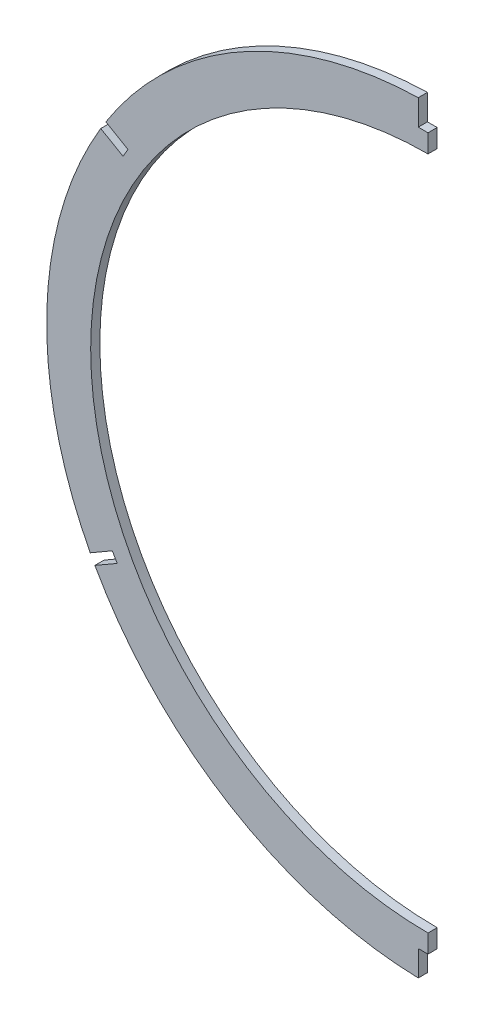
ISO-10303-21;
HEADER;
FILE_DESCRIPTION(('STEP AP214'),'2;1');
FILE_NAME('part.step','',(''),(''),'','','');
FILE_SCHEMA(('AUTOMOTIVE_DESIGN { 1 0 10303 214 1 1 1 1 }'));
ENDSEC;
DATA;
#1=APPLICATION_CONTEXT('core data for automotive mechanical design processes');
#2=APPLICATION_PROTOCOL_DEFINITION('international standard','automotive_design',2000,#1);
#3=PRODUCT_CONTEXT('',#1,'mechanical');
#4=PRODUCT('Part','Part','',(#3));
#5=PRODUCT_RELATED_PRODUCT_CATEGORY('part','',(#4));
#6=PRODUCT_DEFINITION_FORMATION('','',#4);
#7=PRODUCT_DEFINITION_CONTEXT('part definition',#1,'design');
#8=PRODUCT_DEFINITION('design','',#6,#7);
#9=PRODUCT_DEFINITION_SHAPE('','',#8);
#10=(LENGTH_UNIT() NAMED_UNIT(*) SI_UNIT(.MILLI.,.METRE.));
#11=(NAMED_UNIT(*) PLANE_ANGLE_UNIT() SI_UNIT($,.RADIAN.));
#12=(NAMED_UNIT(*) SI_UNIT($,.STERADIAN.) SOLID_ANGLE_UNIT());
#13=UNCERTAINTY_MEASURE_WITH_UNIT(LENGTH_MEASURE(1.E-05),#10,'distance_accuracy_value','');
#14=(GEOMETRIC_REPRESENTATION_CONTEXT(3) GLOBAL_UNCERTAINTY_ASSIGNED_CONTEXT((#13)) GLOBAL_UNIT_ASSIGNED_CONTEXT((#10,
#11,#12)) REPRESENTATION_CONTEXT('',''));
#15=CARTESIAN_POINT('',(0.,0.,0.));
#16=DIRECTION('',(0.,0.,1.));
#17=DIRECTION('',(1.,0.,0.));
#18=AXIS2_PLACEMENT_3D('',#15,#16,#17);
#19=CARTESIAN_POINT('',(0.,-3.556,1.5875));
#20=DIRECTION('',(0.,0.,-1.));
#21=DIRECTION('',(-1.,0.,0.));
#22=AXIS2_PLACEMENT_3D('',#19,#20,#21);
#23=CYLINDRICAL_SURFACE('',#22,132.08);
#24=CARTESIAN_POINT('',(0.,-3.556,-1.5875));
#25=DIRECTION('',(0.,0.,1.));
#26=DIRECTION('',(1.,0.,0.));
#27=AXIS2_PLACEMENT_3D('',#24,#25,#26);
#28=CIRCLE('',#27,132.08);
#29=CARTESIAN_POINT('',(-113.35726398149,64.2323257104845,-1.5875));
#30=VERTEX_POINT('',#29);
#31=CARTESIAN_POINT('',(-116.991774889811,-64.8589445306805,-1.5875));
#32=VERTEX_POINT('',#31);
#33=EDGE_CURVE('E251',#30,#32,#28,.T.);
#34=ORIENTED_EDGE('',*,*,#33,.T.);
#35=DIRECTION('',(0.,0.,-1.));
#36=VECTOR('',#35,1.);
#37=CARTESIAN_POINT('',(-116.991774889811,-64.8589445306805,1.5875));
#38=LINE('',#37,#36);
#39=CARTESIAN_POINT('',(-116.991774889811,-64.8589445306805,1.5875));
#40=VERTEX_POINT('',#39);
#41=EDGE_CURVE('E265',#32,#40,#38,.F.);
#42=ORIENTED_EDGE('',*,*,#41,.T.);
#43=CARTESIAN_POINT('',(0.,-3.556,1.5875));
#44=DIRECTION('',(0.,0.,1.));
#45=DIRECTION('',(1.,0.,0.));
#46=AXIS2_PLACEMENT_3D('',#43,#44,#45);
#47=CIRCLE('',#46,132.08);
#48=CARTESIAN_POINT('',(-113.35726398149,64.2323257104845,1.5875));
#49=VERTEX_POINT('',#48);
#50=EDGE_CURVE('E247',#49,#40,#47,.T.);
#51=ORIENTED_EDGE('',*,*,#50,.F.);
#52=DIRECTION('',(0.,0.,-1.));
#53=VECTOR('',#52,1.);
#54=CARTESIAN_POINT('',(-113.35726398149,64.2323257104845,1.5875));
#55=LINE('',#54,#53);
#56=EDGE_CURVE('E258',#49,#30,#55,.T.);
#57=ORIENTED_EDGE('',*,*,#56,.T.);
#58=EDGE_LOOP('',(#34,#42,#51,#57));
#59=FACE_BOUND('',#58,.T.);
#60=ADVANCED_FACE('F36',(#59),#23,.T.);
#61=CARTESIAN_POINT('',(-3.3782,128.480790951462,1.5875));
#62=VERTEX_POINT('',#61);
#63=CARTESIAN_POINT('',(-111.585794735263,67.1103768230669,1.5875));
#64=VERTEX_POINT('',#63);
#65=EDGE_CURVE('E248',#62,#64,#47,.T.);
#66=ORIENTED_EDGE('',*,*,#65,.F.);
#67=DIRECTION('',(0.,0.,-1.));
#68=VECTOR('',#67,1.);
#69=CARTESIAN_POINT('',(-3.3782,128.480790951462,1.5875));
#70=LINE('',#69,#68);
#71=CARTESIAN_POINT('',(-3.3782,128.480790951462,-1.5875));
#72=VERTEX_POINT('',#71);
#73=EDGE_CURVE('E11',#62,#72,#70,.T.);
#74=ORIENTED_EDGE('',*,*,#73,.T.);
#75=CARTESIAN_POINT('',(-111.585794735263,67.1103768230669,-1.5875));
#76=VERTEX_POINT('',#75);
#77=EDGE_CURVE('E171',#72,#76,#28,.T.);
#78=ORIENTED_EDGE('',*,*,#77,.T.);
#79=DIRECTION('',(0.,0.,-1.));
#80=VECTOR('',#79,1.);
#81=CARTESIAN_POINT('',(-111.585794735263,67.1103768230669,1.5875));
#82=LINE('',#81,#80);
#83=EDGE_CURVE('E260',#76,#64,#82,.F.);
#84=ORIENTED_EDGE('',*,*,#83,.T.);
#85=EDGE_LOOP('',(#66,#74,#78,#84));
#86=FACE_BOUND('',#85,.T.);
#87=ADVANCED_FACE('F304',(#86),#23,.T.);
#88=CARTESIAN_POINT('',(0.,-3.556,1.5875));
#89=DIRECTION('',(0.,0.,1.));
#90=DIRECTION('',(1.,0.,0.));
#91=AXIS2_PLACEMENT_3D('',#88,#89,#90);
#92=PLANE('',#91);
#93=DIRECTION('',(0.,-1.,0.));
#94=VECTOR('',#93,1.);
#95=CARTESIAN_POINT('',(-3.3782,119.634,1.5875));
#96=LINE('',#95,#94);
#97=CARTESIAN_POINT('',(-3.3782,119.634,1.5875));
#98=VERTEX_POINT('',#97);
#99=EDGE_CURVE('E154',#62,#98,#96,.T.);
#100=ORIENTED_EDGE('',*,*,#99,.F.);
#101=ORIENTED_EDGE('',*,*,#65,.T.);
#102=DIRECTION('',(-0.866025403784439,0.499999999999999,0.));
#103=VECTOR('',#102,1.);
#104=CARTESIAN_POINT('',(-103.931466897998,62.6911485857563,1.5875));
#105=LINE('',#104,#103);
#106=CARTESIAN_POINT('',(-103.931466897998,62.6911485857563,1.5875));
#107=VERTEX_POINT('',#106);
#108=EDGE_CURVE('E220',#107,#64,#105,.T.);
#109=ORIENTED_EDGE('',*,*,#108,.F.);
#110=DIRECTION('',(0.500000000000002,0.866025403784437,0.));
#111=VECTOR('',#110,1.);
#112=CARTESIAN_POINT('',(-105.620566897998,59.7655415666918,1.5875));
#113=LINE('',#112,#111);
#114=CARTESIAN_POINT('',(-105.620566897998,59.7655415666918,1.5875));
#115=VERTEX_POINT('',#114);
#116=EDGE_CURVE('E222',#115,#107,#113,.T.);
#117=ORIENTED_EDGE('',*,*,#116,.F.);
#118=DIRECTION('',(0.866025403784438,-0.500000000000001,0.));
#119=VECTOR('',#118,1.);
#120=CARTESIAN_POINT('',(-105.620566897998,59.7655415666918,1.5875));
#121=LINE('',#120,#119);
#122=EDGE_CURVE('E201',#49,#115,#121,.T.);
#123=ORIENTED_EDGE('',*,*,#122,.F.);
#124=ORIENTED_EDGE('',*,*,#50,.T.);
#125=DIRECTION('',(-0.866025403784439,-0.5,0.));
#126=VECTOR('',#125,1.);
#127=CARTESIAN_POINT('',(-109.337447052546,-60.4397162933699,1.5875));
#128=LINE('',#127,#126);
#129=CARTESIAN_POINT('',(-109.337447052546,-60.4397162933699,1.5875));
#130=VERTEX_POINT('',#129);
#131=EDGE_CURVE('E185',#130,#40,#128,.T.);
#132=ORIENTED_EDGE('',*,*,#131,.F.);
#133=DIRECTION('',(-0.500000000000001,0.866025403784438,0.));
#134=VECTOR('',#133,1.);
#135=CARTESIAN_POINT('',(-107.648347052546,-63.3653233124345,1.5875));
#136=LINE('',#135,#134);
#137=CARTESIAN_POINT('',(-107.648347052546,-63.3653233124345,1.5875));
#138=VERTEX_POINT('',#137);
#139=EDGE_CURVE('E202',#138,#130,#136,.T.);
#140=ORIENTED_EDGE('',*,*,#139,.F.);
#141=DIRECTION('',(0.866025403784438,0.500000000000001,0.));
#142=VECTOR('',#141,1.);
#143=CARTESIAN_POINT('',(-107.648347052546,-63.3653233124345,1.5875));
#144=LINE('',#143,#142);
#145=CARTESIAN_POINT('',(-115.385044136038,-67.8321074562272,1.5875));
#146=VERTEX_POINT('',#145);
#147=EDGE_CURVE('E205',#146,#138,#144,.T.);
#148=ORIENTED_EDGE('',*,*,#147,.F.);
#149=CARTESIAN_POINT('',(-3.3782,-135.592790951462,1.5875));
#150=VERTEX_POINT('',#149);
#151=EDGE_CURVE('E244',#146,#150,#47,.T.);
#152=ORIENTED_EDGE('',*,*,#151,.T.);
#153=DIRECTION('',(0.,-1.,0.));
#154=VECTOR('',#153,1.);
#155=CARTESIAN_POINT('',(-3.3782,-126.746,1.5875));
#156=LINE('',#155,#154);
#157=CARTESIAN_POINT('',(-3.3782,-126.746,1.5875));
#158=VERTEX_POINT('',#157);
#159=EDGE_CURVE('E176',#158,#150,#156,.T.);
#160=ORIENTED_EDGE('',*,*,#159,.F.);
#161=DIRECTION('',(-1.,0.,0.));
#162=VECTOR('',#161,1.);
#163=CARTESIAN_POINT('',(0.,-126.746,1.5875));
#164=LINE('',#163,#162);
#165=CARTESIAN_POINT('',(0.,-126.746,1.5875));
#166=VERTEX_POINT('',#165);
#167=EDGE_CURVE('E186',#166,#158,#164,.T.);
#168=ORIENTED_EDGE('',*,*,#167,.F.);
#169=DIRECTION('',(0.,1.,0.));
#170=VECTOR('',#169,1.);
#171=CARTESIAN_POINT('',(0.,-3.556,1.5875));
#172=LINE('',#171,#170);
#173=CARTESIAN_POINT('',(0.,-120.396,1.5875));
#174=VERTEX_POINT('',#173);
#175=EDGE_CURVE('E236',#166,#174,#172,.T.);
#176=ORIENTED_EDGE('',*,*,#175,.T.);
#177=CARTESIAN_POINT('',(0.,-3.556,1.5875));
#178=DIRECTION('',(0.,0.,1.));
#179=DIRECTION('',(1.,0.,0.));
#180=AXIS2_PLACEMENT_3D('',#177,#178,#179);
#181=CIRCLE('',#180,116.84);
#182=CARTESIAN_POINT('',(0.,113.284,1.5875));
#183=VERTEX_POINT('',#182);
#184=EDGE_CURVE('E237',#183,#174,#181,.T.);
#185=ORIENTED_EDGE('',*,*,#184,.F.);
#186=CARTESIAN_POINT('',(0.,119.634,1.5875));
#187=VERTEX_POINT('',#186);
#188=EDGE_CURVE('E232',#183,#187,#172,.T.);
#189=ORIENTED_EDGE('',*,*,#188,.T.);
#190=DIRECTION('',(1.,0.,0.));
#191=VECTOR('',#190,1.);
#192=CARTESIAN_POINT('',(0.,119.634,1.5875));
#193=LINE('',#192,#191);
#194=EDGE_CURVE('E172',#98,#187,#193,.T.);
#195=ORIENTED_EDGE('',*,*,#194,.F.);
#196=EDGE_LOOP('',(#100,#101,#109,#117,#123,#124,#132,#140,#148,#152,#160,#168,#176,#185,#189,#195));
#197=FACE_BOUND('',#196,.T.);
#198=ADVANCED_FACE('F276',(#197),#92,.T.);
#199=CARTESIAN_POINT('',(0.,-3.556,-1.5875));
#200=DIRECTION('',(0.,0.,1.));
#201=DIRECTION('',(1.,0.,0.));
#202=AXIS2_PLACEMENT_3D('',#199,#200,#201);
#203=PLANE('',#202);
#204=ORIENTED_EDGE('',*,*,#77,.F.);
#205=DIRECTION('',(0.,-1.,0.));
#206=VECTOR('',#205,1.);
#207=CARTESIAN_POINT('',(-3.3782,119.634,-1.5875));
#208=LINE('',#207,#206);
#209=CARTESIAN_POINT('',(-3.3782,119.634,-1.5875));
#210=VERTEX_POINT('',#209);
#211=EDGE_CURVE('E152',#72,#210,#208,.T.);
#212=ORIENTED_EDGE('',*,*,#211,.T.);
#213=DIRECTION('',(1.,0.,0.));
#214=VECTOR('',#213,1.);
#215=CARTESIAN_POINT('',(0.,119.634,-1.5875));
#216=LINE('',#215,#214);
#217=CARTESIAN_POINT('',(0.,119.634,-1.5875));
#218=VERTEX_POINT('',#217);
#219=EDGE_CURVE('E158',#210,#218,#216,.T.);
#220=ORIENTED_EDGE('',*,*,#219,.T.);
#221=DIRECTION('',(0.,1.,0.));
#222=VECTOR('',#221,1.);
#223=CARTESIAN_POINT('',(0.,-3.556,-1.5875));
#224=LINE('',#223,#222);
#225=CARTESIAN_POINT('',(0.,113.284,-1.5875));
#226=VERTEX_POINT('',#225);
#227=EDGE_CURVE('E178',#226,#218,#224,.T.);
#228=ORIENTED_EDGE('',*,*,#227,.F.);
#229=CARTESIAN_POINT('',(0.,-3.556,-1.5875));
#230=DIRECTION('',(0.,0.,1.));
#231=DIRECTION('',(1.,0.,0.));
#232=AXIS2_PLACEMENT_3D('',#229,#230,#231);
#233=CIRCLE('',#232,116.84);
#234=CARTESIAN_POINT('',(0.,-120.396,-1.5875));
#235=VERTEX_POINT('',#234);
#236=EDGE_CURVE('E241',#226,#235,#233,.T.);
#237=ORIENTED_EDGE('',*,*,#236,.T.);
#238=CARTESIAN_POINT('',(0.,-126.746,-1.5875));
#239=VERTEX_POINT('',#238);
#240=EDGE_CURVE('E233',#239,#235,#224,.T.);
#241=ORIENTED_EDGE('',*,*,#240,.F.);
#242=DIRECTION('',(-1.,0.,0.));
#243=VECTOR('',#242,1.);
#244=CARTESIAN_POINT('',(0.,-126.746,-1.5875));
#245=LINE('',#244,#243);
#246=CARTESIAN_POINT('',(-3.3782,-126.746,-1.5875));
#247=VERTEX_POINT('',#246);
#248=EDGE_CURVE('E182',#239,#247,#245,.T.);
#249=ORIENTED_EDGE('',*,*,#248,.T.);
#250=DIRECTION('',(0.,-1.,0.));
#251=VECTOR('',#250,1.);
#252=CARTESIAN_POINT('',(-3.3782,-126.746,-1.5875));
#253=LINE('',#252,#251);
#254=CARTESIAN_POINT('',(-3.3782,-135.592790951462,-1.5875));
#255=VERTEX_POINT('',#254);
#256=EDGE_CURVE('E189',#247,#255,#253,.T.);
#257=ORIENTED_EDGE('',*,*,#256,.T.);
#258=CARTESIAN_POINT('',(-115.385044136038,-67.8321074562272,-1.5875));
#259=VERTEX_POINT('',#258);
#260=EDGE_CURVE('E240',#259,#255,#28,.T.);
#261=ORIENTED_EDGE('',*,*,#260,.F.);
#262=DIRECTION('',(0.866025403784438,0.500000000000001,0.));
#263=VECTOR('',#262,1.);
#264=CARTESIAN_POINT('',(-107.648347052546,-63.3653233124345,-1.5875));
#265=LINE('',#264,#263);
#266=CARTESIAN_POINT('',(-107.648347052546,-63.3653233124345,-1.5875));
#267=VERTEX_POINT('',#266);
#268=EDGE_CURVE('E51',#259,#267,#265,.T.);
#269=ORIENTED_EDGE('',*,*,#268,.T.);
#270=DIRECTION('',(-0.500000000000001,0.866025403784438,0.));
#271=VECTOR('',#270,1.);
#272=CARTESIAN_POINT('',(-107.648347052546,-63.3653233124345,-1.5875));
#273=LINE('',#272,#271);
#274=CARTESIAN_POINT('',(-109.337447052546,-60.4397162933699,-1.5875));
#275=VERTEX_POINT('',#274);
#276=EDGE_CURVE('E198',#267,#275,#273,.T.);
#277=ORIENTED_EDGE('',*,*,#276,.T.);
#278=DIRECTION('',(-0.866025403784439,-0.5,0.));
#279=VECTOR('',#278,1.);
#280=CARTESIAN_POINT('',(-109.337447052546,-60.4397162933699,-1.5875));
#281=LINE('',#280,#279);
#282=EDGE_CURVE('E206',#275,#32,#281,.T.);
#283=ORIENTED_EDGE('',*,*,#282,.T.);
#284=ORIENTED_EDGE('',*,*,#33,.F.);
#285=DIRECTION('',(0.866025403784438,-0.500000000000001,0.));
#286=VECTOR('',#285,1.);
#287=CARTESIAN_POINT('',(-105.620566897998,59.7655415666918,-1.5875));
#288=LINE('',#287,#286);
#289=CARTESIAN_POINT('',(-105.620566897998,59.7655415666918,-1.5875));
#290=VERTEX_POINT('',#289);
#291=EDGE_CURVE('E59',#30,#290,#288,.T.);
#292=ORIENTED_EDGE('',*,*,#291,.T.);
#293=DIRECTION('',(0.500000000000002,0.866025403784437,0.));
#294=VECTOR('',#293,1.);
#295=CARTESIAN_POINT('',(-105.620566897998,59.7655415666918,-1.5875));
#296=LINE('',#295,#294);
#297=CARTESIAN_POINT('',(-103.931466897998,62.6911485857563,-1.5875));
#298=VERTEX_POINT('',#297);
#299=EDGE_CURVE('E227',#290,#298,#296,.T.);
#300=ORIENTED_EDGE('',*,*,#299,.T.);
#301=DIRECTION('',(-0.866025403784439,0.499999999999999,0.));
#302=VECTOR('',#301,1.);
#303=CARTESIAN_POINT('',(-103.931466897998,62.6911485857563,-1.5875));
#304=LINE('',#303,#302);
#305=EDGE_CURVE('E217',#298,#76,#304,.T.);
#306=ORIENTED_EDGE('',*,*,#305,.T.);
#307=EDGE_LOOP('',(#204,#212,#220,#228,#237,#241,#249,#257,#261,#269,#277,#283,#284,#292,#300,#306));
#308=FACE_BOUND('',#307,.T.);
#309=ADVANCED_FACE('F168',(#308),#203,.F.);
#310=ORIENTED_EDGE('',*,*,#260,.T.);
#311=DIRECTION('',(0.,0.,-1.));
#312=VECTOR('',#311,1.);
#313=CARTESIAN_POINT('',(-3.3782,-135.592790951462,1.5875));
#314=LINE('',#313,#312);
#315=EDGE_CURVE('E44',#255,#150,#314,.F.);
#316=ORIENTED_EDGE('',*,*,#315,.T.);
#317=ORIENTED_EDGE('',*,*,#151,.F.);
#318=DIRECTION('',(0.,0.,-1.));
#319=VECTOR('',#318,1.);
#320=CARTESIAN_POINT('',(-115.385044136038,-67.8321074562272,1.5875));
#321=LINE('',#320,#319);
#322=EDGE_CURVE('E263',#146,#259,#321,.T.);
#323=ORIENTED_EDGE('',*,*,#322,.T.);
#324=EDGE_LOOP('',(#310,#316,#317,#323));
#325=FACE_BOUND('',#324,.T.);
#326=ADVANCED_FACE('F38',(#325),#23,.T.);
#327=CARTESIAN_POINT('',(0.,-3.556,1.5875));
#328=DIRECTION('',(0.,0.,-1.));
#329=DIRECTION('',(-1.,0.,0.));
#330=AXIS2_PLACEMENT_3D('',#327,#328,#329);
#331=CYLINDRICAL_SURFACE('',#330,116.84);
#332=ORIENTED_EDGE('',*,*,#184,.T.);
#333=DIRECTION('',(0.,0.,-1.));
#334=VECTOR('',#333,1.);
#335=CARTESIAN_POINT('',(0.,-120.396,1.5875));
#336=LINE('',#335,#334);
#337=EDGE_CURVE('E255',#174,#235,#336,.T.);
#338=ORIENTED_EDGE('',*,*,#337,.T.);
#339=ORIENTED_EDGE('',*,*,#236,.F.);
#340=DIRECTION('',(0.,0.,-1.));
#341=VECTOR('',#340,1.);
#342=CARTESIAN_POINT('',(0.,113.284,1.5875));
#343=LINE('',#342,#341);
#344=EDGE_CURVE('E252',#226,#183,#343,.F.);
#345=ORIENTED_EDGE('',*,*,#344,.T.);
#346=EDGE_LOOP('',(#332,#338,#339,#345));
#347=FACE_BOUND('',#346,.T.);
#348=ADVANCED_FACE('F297',(#347),#331,.F.);
#349=CARTESIAN_POINT('',(0.,0.,0.));
#350=DIRECTION('',(1.,0.,0.));
#351=DIRECTION('',(0.,0.,-1.));
#352=AXIS2_PLACEMENT_3D('',#349,#350,#351);
#353=PLANE('',#352);
#354=DIRECTION('',(0.,0.,1.));
#355=VECTOR('',#354,1.);
#356=CARTESIAN_POINT('',(0.,119.634,-1.5875));
#357=LINE('',#356,#355);
#358=EDGE_CURVE('E157',#218,#187,#357,.T.);
#359=ORIENTED_EDGE('',*,*,#358,.T.);
#360=ORIENTED_EDGE('',*,*,#188,.F.);
#361=ORIENTED_EDGE('',*,*,#344,.F.);
#362=ORIENTED_EDGE('',*,*,#227,.T.);
#363=EDGE_LOOP('',(#359,#360,#361,#362));
#364=FACE_BOUND('',#363,.T.);
#365=ADVANCED_FACE('F299',(#364),#353,.T.);
#366=DIRECTION('',(0.,0.,1.));
#367=VECTOR('',#366,1.);
#368=CARTESIAN_POINT('',(0.,-126.746,-1.5875));
#369=LINE('',#368,#367);
#370=EDGE_CURVE('E180',#239,#166,#369,.T.);
#371=ORIENTED_EDGE('',*,*,#370,.F.);
#372=ORIENTED_EDGE('',*,*,#240,.T.);
#373=ORIENTED_EDGE('',*,*,#337,.F.);
#374=ORIENTED_EDGE('',*,*,#175,.F.);
#375=EDGE_LOOP('',(#371,#372,#373,#374));
#376=FACE_BOUND('',#375,.T.);
#377=ADVANCED_FACE('F294',(#376),#353,.T.);
#378=CARTESIAN_POINT('',(-3.3782,-126.746,-1.5875));
#379=DIRECTION('',(-1.,0.,0.));
#380=DIRECTION('',(0.,0.,1.));
#381=AXIS2_PLACEMENT_3D('',#378,#379,#380);
#382=PLANE('',#381);
#383=ORIENTED_EDGE('',*,*,#256,.F.);
#384=DIRECTION('',(0.,0.,1.));
#385=VECTOR('',#384,1.);
#386=CARTESIAN_POINT('',(-3.3782,-126.746,-1.5875));
#387=LINE('',#386,#385);
#388=EDGE_CURVE('E183',#247,#158,#387,.T.);
#389=ORIENTED_EDGE('',*,*,#388,.T.);
#390=ORIENTED_EDGE('',*,*,#159,.T.);
#391=ORIENTED_EDGE('',*,*,#315,.F.);
#392=EDGE_LOOP('',(#383,#389,#390,#391));
#393=FACE_BOUND('',#392,.T.);
#394=ADVANCED_FACE('F286',(#393),#382,.F.);
#395=CARTESIAN_POINT('',(0.,-126.746,-1.5875));
#396=DIRECTION('',(0.,1.,0.));
#397=DIRECTION('',(0.,0.,1.));
#398=AXIS2_PLACEMENT_3D('',#395,#396,#397);
#399=PLANE('',#398);
#400=ORIENTED_EDGE('',*,*,#167,.T.);
#401=ORIENTED_EDGE('',*,*,#388,.F.);
#402=ORIENTED_EDGE('',*,*,#248,.F.);
#403=ORIENTED_EDGE('',*,*,#370,.T.);
#404=EDGE_LOOP('',(#400,#401,#402,#403));
#405=FACE_BOUND('',#404,.T.);
#406=ADVANCED_FACE('F288',(#405),#399,.F.);
#407=CARTESIAN_POINT('',(-3.3782,119.634,-1.5875));
#408=DIRECTION('',(-1.,0.,0.));
#409=DIRECTION('',(0.,0.,1.));
#410=AXIS2_PLACEMENT_3D('',#407,#408,#409);
#411=PLANE('',#410);
#412=ORIENTED_EDGE('',*,*,#99,.T.);
#413=DIRECTION('',(0.,0.,1.));
#414=VECTOR('',#413,1.);
#415=CARTESIAN_POINT('',(-3.3782,119.634,-1.5875));
#416=LINE('',#415,#414);
#417=EDGE_CURVE('E148',#210,#98,#416,.T.);
#418=ORIENTED_EDGE('',*,*,#417,.F.);
#419=ORIENTED_EDGE('',*,*,#211,.F.);
#420=ORIENTED_EDGE('',*,*,#73,.F.);
#421=EDGE_LOOP('',(#412,#418,#419,#420));
#422=FACE_BOUND('',#421,.T.);
#423=ADVANCED_FACE('F150',(#422),#411,.F.);
#424=CARTESIAN_POINT('',(0.,119.634,-1.5875));
#425=DIRECTION('',(0.,-1.,0.));
#426=DIRECTION('',(0.,0.,-1.));
#427=AXIS2_PLACEMENT_3D('',#424,#425,#426);
#428=PLANE('',#427);
#429=ORIENTED_EDGE('',*,*,#194,.T.);
#430=ORIENTED_EDGE('',*,*,#358,.F.);
#431=ORIENTED_EDGE('',*,*,#219,.F.);
#432=ORIENTED_EDGE('',*,*,#417,.T.);
#433=EDGE_LOOP('',(#429,#430,#431,#432));
#434=FACE_BOUND('',#433,.T.);
#435=ADVANCED_FACE('F161',(#434),#428,.F.);
#436=CARTESIAN_POINT('',(-103.931466897998,62.6911485857563,-1.5875));
#437=DIRECTION('',(0.499999999999999,0.866025403784439,0.));
#438=DIRECTION('',(-0.866025403784439,0.499999999999999,0.));
#439=AXIS2_PLACEMENT_3D('',#436,#437,#438);
#440=PLANE('',#439);
#441=ORIENTED_EDGE('',*,*,#305,.F.);
#442=DIRECTION('',(0.,0.,1.));
#443=VECTOR('',#442,1.);
#444=CARTESIAN_POINT('',(-103.931466897998,62.6911485857563,-1.5875));
#445=LINE('',#444,#443);
#446=EDGE_CURVE('E218',#298,#107,#445,.T.);
#447=ORIENTED_EDGE('',*,*,#446,.T.);
#448=ORIENTED_EDGE('',*,*,#108,.T.);
#449=ORIENTED_EDGE('',*,*,#83,.F.);
#450=EDGE_LOOP('',(#441,#447,#448,#449));
#451=FACE_BOUND('',#450,.T.);
#452=ADVANCED_FACE('F319',(#451),#440,.F.);
#453=CARTESIAN_POINT('',(-105.620566897998,59.7655415666918,-1.5875));
#454=DIRECTION('',(-0.500000000000001,-0.866025403784438,0.));
#455=DIRECTION('',(0.866025403784438,-0.500000000000001,0.));
#456=AXIS2_PLACEMENT_3D('',#453,#454,#455);
#457=PLANE('',#456);
#458=ORIENTED_EDGE('',*,*,#122,.T.);
#459=DIRECTION('',(0.,0.,1.));
#460=VECTOR('',#459,1.);
#461=CARTESIAN_POINT('',(-105.620566897998,59.7655415666918,-1.5875));
#462=LINE('',#461,#460);
#463=EDGE_CURVE('E214',#290,#115,#462,.T.);
#464=ORIENTED_EDGE('',*,*,#463,.F.);
#465=ORIENTED_EDGE('',*,*,#291,.F.);
#466=ORIENTED_EDGE('',*,*,#56,.F.);
#467=EDGE_LOOP('',(#458,#464,#465,#466));
#468=FACE_BOUND('',#467,.T.);
#469=ADVANCED_FACE('F321',(#468),#457,.F.);
#470=CARTESIAN_POINT('',(-105.620566897998,59.7655415666918,-1.5875));
#471=DIRECTION('',(0.866025403784437,-0.500000000000002,0.));
#472=DIRECTION('',(0.500000000000002,0.866025403784438,0.));
#473=AXIS2_PLACEMENT_3D('',#470,#471,#472);
#474=PLANE('',#473);
#475=ORIENTED_EDGE('',*,*,#116,.T.);
#476=ORIENTED_EDGE('',*,*,#446,.F.);
#477=ORIENTED_EDGE('',*,*,#299,.F.);
#478=ORIENTED_EDGE('',*,*,#463,.T.);
#479=EDGE_LOOP('',(#475,#476,#477,#478));
#480=FACE_BOUND('',#479,.T.);
#481=ADVANCED_FACE('F317',(#480),#474,.F.);
#482=CARTESIAN_POINT('',(-109.337447052546,-60.4397162933699,-1.5875));
#483=DIRECTION('',(-0.5,0.866025403784439,0.));
#484=DIRECTION('',(-0.866025403784439,-0.5,0.));
#485=AXIS2_PLACEMENT_3D('',#482,#483,#484);
#486=PLANE('',#485);
#487=ORIENTED_EDGE('',*,*,#282,.F.);
#488=DIRECTION('',(0.,0.,1.));
#489=VECTOR('',#488,1.);
#490=CARTESIAN_POINT('',(-109.337447052546,-60.4397162933699,-1.5875));
#491=LINE('',#490,#489);
#492=EDGE_CURVE('E199',#275,#130,#491,.T.);
#493=ORIENTED_EDGE('',*,*,#492,.T.);
#494=ORIENTED_EDGE('',*,*,#131,.T.);
#495=ORIENTED_EDGE('',*,*,#41,.F.);
#496=EDGE_LOOP('',(#487,#493,#494,#495));
#497=FACE_BOUND('',#496,.T.);
#498=ADVANCED_FACE('F313',(#497),#486,.F.);
#499=CARTESIAN_POINT('',(-107.648347052546,-63.3653233124345,-1.5875));
#500=DIRECTION('',(0.500000000000001,-0.866025403784438,0.));
#501=DIRECTION('',(0.866025403784438,0.500000000000001,0.));
#502=AXIS2_PLACEMENT_3D('',#499,#500,#501);
#503=PLANE('',#502);
#504=ORIENTED_EDGE('',*,*,#147,.T.);
#505=DIRECTION('',(0.,0.,1.));
#506=VECTOR('',#505,1.);
#507=CARTESIAN_POINT('',(-107.648347052546,-63.3653233124345,-1.5875));
#508=LINE('',#507,#506);
#509=EDGE_CURVE('E195',#267,#138,#508,.T.);
#510=ORIENTED_EDGE('',*,*,#509,.F.);
#511=ORIENTED_EDGE('',*,*,#268,.F.);
#512=ORIENTED_EDGE('',*,*,#322,.F.);
#513=EDGE_LOOP('',(#504,#510,#511,#512));
#514=FACE_BOUND('',#513,.T.);
#515=ADVANCED_FACE('F280',(#514),#503,.F.);
#516=CARTESIAN_POINT('',(-107.648347052546,-63.3653233124345,-1.5875));
#517=DIRECTION('',(0.866025403784438,0.500000000000001,0.));
#518=DIRECTION('',(-0.500000000000001,0.866025403784438,0.));
#519=AXIS2_PLACEMENT_3D('',#516,#517,#518);
#520=PLANE('',#519);
#521=ORIENTED_EDGE('',*,*,#139,.T.);
#522=ORIENTED_EDGE('',*,*,#492,.F.);
#523=ORIENTED_EDGE('',*,*,#276,.F.);
#524=ORIENTED_EDGE('',*,*,#509,.T.);
#525=EDGE_LOOP('',(#521,#522,#523,#524));
#526=FACE_BOUND('',#525,.T.);
#527=ADVANCED_FACE('F283',(#526),#520,.F.);
#528=CLOSED_SHELL('',(#60,#87,#198,#309,#326,#348,#365,#377,#394,#406,#423,#435,#452,#469,#481,
#498,#515,#527));
#529=MANIFOLD_SOLID_BREP('B2',#528);
#530=ADVANCED_BREP_SHAPE_REPRESENTATION('',(#18,#529),#14);
#531=SHAPE_DEFINITION_REPRESENTATION(#9,#530);
ENDSEC;
END-ISO-10303-21;
